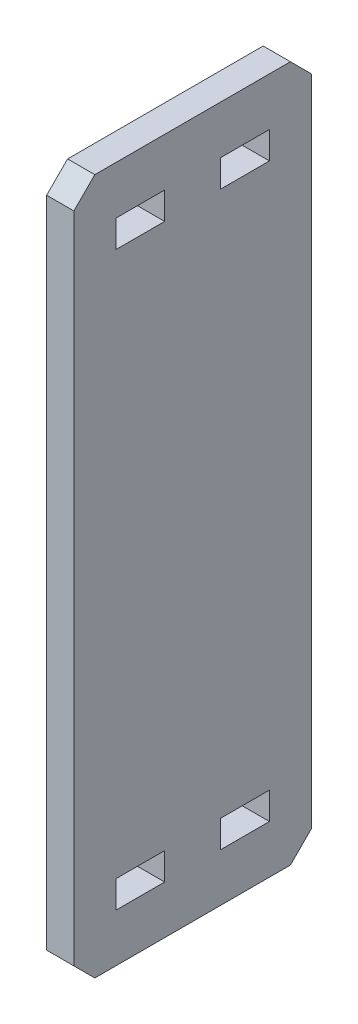
ISO-10303-21;
HEADER;
FILE_DESCRIPTION(('STEP AP214'),'2;1');
FILE_NAME('part.step','',(''),(''),'','','');
FILE_SCHEMA(('AUTOMOTIVE_DESIGN { 1 0 10303 214 1 1 1 1 }'));
ENDSEC;
DATA;
#1=APPLICATION_CONTEXT('core data for automotive mechanical design processes');
#2=APPLICATION_PROTOCOL_DEFINITION('international standard','automotive_design',2000,#1);
#3=PRODUCT_CONTEXT('',#1,'mechanical');
#4=PRODUCT('Part','Part','',(#3));
#5=PRODUCT_RELATED_PRODUCT_CATEGORY('part','',(#4));
#6=PRODUCT_DEFINITION_FORMATION('','',#4);
#7=PRODUCT_DEFINITION_CONTEXT('part definition',#1,'design');
#8=PRODUCT_DEFINITION('design','',#6,#7);
#9=PRODUCT_DEFINITION_SHAPE('','',#8);
#10=(LENGTH_UNIT() NAMED_UNIT(*) SI_UNIT(.MILLI.,.METRE.));
#11=(NAMED_UNIT(*) PLANE_ANGLE_UNIT() SI_UNIT($,.RADIAN.));
#12=(NAMED_UNIT(*) SI_UNIT($,.STERADIAN.) SOLID_ANGLE_UNIT());
#13=UNCERTAINTY_MEASURE_WITH_UNIT(LENGTH_MEASURE(1.E-05),#10,'distance_accuracy_value','');
#14=(GEOMETRIC_REPRESENTATION_CONTEXT(3) GLOBAL_UNCERTAINTY_ASSIGNED_CONTEXT((#13)) GLOBAL_UNIT_ASSIGNED_CONTEXT((#10,
#11,#12)) REPRESENTATION_CONTEXT('',''));
#15=CARTESIAN_POINT('',(0.,0.,0.));
#16=DIRECTION('',(0.,0.,1.));
#17=DIRECTION('',(1.,0.,0.));
#18=AXIS2_PLACEMENT_3D('',#15,#16,#17);
#19=CARTESIAN_POINT('',(2.4765,0.,0.));
#20=DIRECTION('',(-1.,0.,0.));
#21=DIRECTION('',(0.,0.,1.));
#22=AXIS2_PLACEMENT_3D('',#19,#20,#21);
#23=PLANE('',#22);
#24=DIRECTION('',(0.,0.,1.));
#25=VECTOR('',#24,1.);
#26=CARTESIAN_POINT('',(2.4765,-49.53,116.107292876109));
#27=LINE('',#26,#25);
#28=CARTESIAN_POINT('',(2.4765,-49.53,116.107292876109));
#29=VERTEX_POINT('',#28);
#30=CARTESIAN_POINT('',(2.4765,-49.53,124.997292876109));
#31=VERTEX_POINT('',#30);
#32=EDGE_CURVE('E238',#29,#31,#27,.T.);
#33=ORIENTED_EDGE('',*,*,#32,.F.);
#34=DIRECTION('',(0.,1.,0.));
#35=VECTOR('',#34,1.);
#36=CARTESIAN_POINT('',(2.4765,-49.53,116.107292876109));
#37=LINE('',#36,#35);
#38=CARTESIAN_POINT('',(2.4765,-54.483,116.107292876109));
#39=VERTEX_POINT('',#38);
#40=EDGE_CURVE('E246',#39,#29,#37,.T.);
#41=ORIENTED_EDGE('',*,*,#40,.F.);
#42=DIRECTION('',(0.,0.,-1.));
#43=VECTOR('',#42,1.);
#44=CARTESIAN_POINT('',(2.4765,-54.483,116.107292876109));
#45=LINE('',#44,#43);
#46=CARTESIAN_POINT('',(2.4765,-54.483,124.997292876109));
#47=VERTEX_POINT('',#46);
#48=EDGE_CURVE('E243',#47,#39,#45,.T.);
#49=ORIENTED_EDGE('',*,*,#48,.F.);
#50=DIRECTION('',(0.,-1.,0.));
#51=VECTOR('',#50,1.);
#52=CARTESIAN_POINT('',(2.4765,-49.53,124.997292876109));
#53=LINE('',#52,#51);
#54=EDGE_CURVE('E240',#31,#47,#53,.T.);
#55=ORIENTED_EDGE('',*,*,#54,.F.);
#56=EDGE_LOOP('',(#33,#41,#49,#55));
#57=FACE_BOUND('',#56,.T.);
#58=DIRECTION('',(0.,-1.,0.));
#59=VECTOR('',#58,1.);
#60=CARTESIAN_POINT('',(2.4765,54.483,105.947292876109));
#61=LINE('',#60,#59);
#62=CARTESIAN_POINT('',(2.4765,54.483,105.947292876109));
#63=VERTEX_POINT('',#62);
#64=CARTESIAN_POINT('',(2.4765,49.53,105.947292876109));
#65=VERTEX_POINT('',#64);
#66=EDGE_CURVE('E300',#63,#65,#61,.T.);
#67=ORIENTED_EDGE('',*,*,#66,.F.);
#68=DIRECTION('',(0.,0.,1.));
#69=VECTOR('',#68,1.);
#70=CARTESIAN_POINT('',(2.4765,54.483,97.0572928761086));
#71=LINE('',#70,#69);
#72=CARTESIAN_POINT('',(2.4765,54.483,97.0572928761086));
#73=VERTEX_POINT('',#72);
#74=EDGE_CURVE('E308',#73,#63,#71,.T.);
#75=ORIENTED_EDGE('',*,*,#74,.F.);
#76=DIRECTION('',(0.,1.,0.));
#77=VECTOR('',#76,1.);
#78=CARTESIAN_POINT('',(2.4765,54.483,97.0572928761086));
#79=LINE('',#78,#77);
#80=CARTESIAN_POINT('',(2.4765,49.53,97.0572928761086));
#81=VERTEX_POINT('',#80);
#82=EDGE_CURVE('E305',#81,#73,#79,.T.);
#83=ORIENTED_EDGE('',*,*,#82,.F.);
#84=DIRECTION('',(0.,0.,-1.));
#85=VECTOR('',#84,1.);
#86=CARTESIAN_POINT('',(2.4765,49.53,97.0572928761086));
#87=LINE('',#86,#85);
#88=EDGE_CURVE('E302',#65,#81,#87,.T.);
#89=ORIENTED_EDGE('',*,*,#88,.F.);
#90=EDGE_LOOP('',(#67,#75,#83,#89));
#91=FACE_BOUND('',#90,.T.);
#92=DIRECTION('',(0.,0.,-1.));
#93=VECTOR('',#92,1.);
#94=CARTESIAN_POINT('',(2.4765,-63.246,89.4372928761086));
#95=LINE('',#94,#93);
#96=CARTESIAN_POINT('',(2.4765,-63.246,128.807292876109));
#97=VERTEX_POINT('',#96);
#98=CARTESIAN_POINT('',(2.4765,-63.246,93.2472928761086));
#99=VERTEX_POINT('',#98);
#100=EDGE_CURVE('E339',#97,#99,#95,.T.);
#101=ORIENTED_EDGE('',*,*,#100,.T.);
#102=DIRECTION('',(0.,-0.707106781186548,0.707106781186548));
#103=VECTOR('',#102,1.);
#104=CARTESIAN_POINT('',(2.4765,-59.436,89.4372928761086));
#105=LINE('',#104,#103);
#106=CARTESIAN_POINT('',(2.4765,-59.436,89.4372928761086));
#107=VERTEX_POINT('',#106);
#108=EDGE_CURVE('E374',#99,#107,#105,.F.);
#109=ORIENTED_EDGE('',*,*,#108,.T.);
#110=DIRECTION('',(0.,1.,0.));
#111=VECTOR('',#110,1.);
#112=CARTESIAN_POINT('',(2.4765,63.246,89.4372928761086));
#113=LINE('',#112,#111);
#114=CARTESIAN_POINT('',(2.4765,59.436,89.4372928761086));
#115=VERTEX_POINT('',#114);
#116=EDGE_CURVE('E331',#107,#115,#113,.T.);
#117=ORIENTED_EDGE('',*,*,#116,.T.);
#118=DIRECTION('',(0.,-0.707106781186548,-0.707106781186547));
#119=VECTOR('',#118,1.);
#120=CARTESIAN_POINT('',(2.4765,63.246,93.2472928761086));
#121=LINE('',#120,#119);
#122=CARTESIAN_POINT('',(2.4765,63.246,93.2472928761086));
#123=VERTEX_POINT('',#122);
#124=EDGE_CURVE('E370',#115,#123,#121,.F.);
#125=ORIENTED_EDGE('',*,*,#124,.T.);
#126=DIRECTION('',(0.,0.,1.));
#127=VECTOR('',#126,1.);
#128=CARTESIAN_POINT('',(2.4765,63.246,89.4372928761086));
#129=LINE('',#128,#127);
#130=CARTESIAN_POINT('',(2.4765,63.246,128.807292876109));
#131=VERTEX_POINT('',#130);
#132=EDGE_CURVE('E334',#123,#131,#129,.T.);
#133=ORIENTED_EDGE('',*,*,#132,.T.);
#134=DIRECTION('',(0.,0.707106781186546,-0.707106781186549));
#135=VECTOR('',#134,1.);
#136=CARTESIAN_POINT('',(2.4765,59.436,132.617292876109));
#137=LINE('',#136,#135);
#138=CARTESIAN_POINT('',(2.4765,59.436,132.617292876109));
#139=VERTEX_POINT('',#138);
#140=EDGE_CURVE('E55',#131,#139,#137,.F.);
#141=ORIENTED_EDGE('',*,*,#140,.T.);
#142=DIRECTION('',(0.,-1.,0.));
#143=VECTOR('',#142,1.);
#144=CARTESIAN_POINT('',(2.4765,63.246,132.617292876109));
#145=LINE('',#144,#143);
#146=CARTESIAN_POINT('',(2.4765,-59.436,132.617292876109));
#147=VERTEX_POINT('',#146);
#148=EDGE_CURVE('E337',#139,#147,#145,.T.);
#149=ORIENTED_EDGE('',*,*,#148,.T.);
#150=DIRECTION('',(0.,0.707106781186549,0.707106781186546));
#151=VECTOR('',#150,1.);
#152=CARTESIAN_POINT('',(2.4765,-63.246,128.807292876109));
#153=LINE('',#152,#151);
#154=EDGE_CURVE('E372',#147,#97,#153,.F.);
#155=ORIENTED_EDGE('',*,*,#154,.T.);
#156=EDGE_LOOP('',(#101,#109,#117,#125,#133,#141,#149,#155));
#157=FACE_BOUND('',#156,.T.);
#158=DIRECTION('',(0.,0.,1.));
#159=VECTOR('',#158,1.);
#160=CARTESIAN_POINT('',(2.4765,54.483,116.107292876109));
#161=LINE('',#160,#159);
#162=CARTESIAN_POINT('',(2.4765,54.483,116.107292876109));
#163=VERTEX_POINT('',#162);
#164=CARTESIAN_POINT('',(2.4765,54.483,124.997292876109));
#165=VERTEX_POINT('',#164);
#166=EDGE_CURVE('E269',#163,#165,#161,.T.);
#167=ORIENTED_EDGE('',*,*,#166,.F.);
#168=DIRECTION('',(0.,1.,0.));
#169=VECTOR('',#168,1.);
#170=CARTESIAN_POINT('',(2.4765,54.483,116.107292876109));
#171=LINE('',#170,#169);
#172=CARTESIAN_POINT('',(2.4765,49.53,116.107292876109));
#173=VERTEX_POINT('',#172);
#174=EDGE_CURVE('E277',#173,#163,#171,.T.);
#175=ORIENTED_EDGE('',*,*,#174,.F.);
#176=DIRECTION('',(0.,0.,-1.));
#177=VECTOR('',#176,1.);
#178=CARTESIAN_POINT('',(2.4765,49.53,116.107292876109));
#179=LINE('',#178,#177);
#180=CARTESIAN_POINT('',(2.4765,49.53,124.997292876109));
#181=VERTEX_POINT('',#180);
#182=EDGE_CURVE('E274',#181,#173,#179,.T.);
#183=ORIENTED_EDGE('',*,*,#182,.F.);
#184=DIRECTION('',(0.,-1.,0.));
#185=VECTOR('',#184,1.);
#186=CARTESIAN_POINT('',(2.4765,54.483,124.997292876109));
#187=LINE('',#186,#185);
#188=EDGE_CURVE('E271',#165,#181,#187,.T.);
#189=ORIENTED_EDGE('',*,*,#188,.F.);
#190=EDGE_LOOP('',(#167,#175,#183,#189));
#191=FACE_BOUND('',#190,.T.);
#192=DIRECTION('',(0.,-1.,0.));
#193=VECTOR('',#192,1.);
#194=CARTESIAN_POINT('',(2.4765,-49.53,105.947292876109));
#195=LINE('',#194,#193);
#196=CARTESIAN_POINT('',(2.4765,-49.53,105.947292876109));
#197=VERTEX_POINT('',#196);
#198=CARTESIAN_POINT('',(2.4765,-54.483,105.947292876109));
#199=VERTEX_POINT('',#198);
#200=EDGE_CURVE('E197',#197,#199,#195,.T.);
#201=ORIENTED_EDGE('',*,*,#200,.F.);
#202=DIRECTION('',(0.,0.,1.));
#203=VECTOR('',#202,1.);
#204=CARTESIAN_POINT('',(2.4765,-49.53,97.0572928761086));
#205=LINE('',#204,#203);
#206=CARTESIAN_POINT('',(2.4765,-49.53,97.0572928761086));
#207=VERTEX_POINT('',#206);
#208=EDGE_CURVE('E222',#207,#197,#205,.T.);
#209=ORIENTED_EDGE('',*,*,#208,.F.);
#210=DIRECTION('',(0.,1.,0.));
#211=VECTOR('',#210,1.);
#212=CARTESIAN_POINT('',(2.4765,-49.53,97.0572928761086));
#213=LINE('',#212,#211);
#214=CARTESIAN_POINT('',(2.4765,-54.483,97.0572928761086));
#215=VERTEX_POINT('',#214);
#216=EDGE_CURVE('E220',#215,#207,#213,.T.);
#217=ORIENTED_EDGE('',*,*,#216,.F.);
#218=DIRECTION('',(0.,0.,-1.));
#219=VECTOR('',#218,1.);
#220=CARTESIAN_POINT('',(2.4765,-54.483,97.0572928761086));
#221=LINE('',#220,#219);
#222=EDGE_CURVE('E207',#199,#215,#221,.T.);
#223=ORIENTED_EDGE('',*,*,#222,.F.);
#224=EDGE_LOOP('',(#201,#209,#217,#223));
#225=FACE_BOUND('',#224,.T.);
#226=ADVANCED_FACE('F33',(#57,#91,#157,#191,#225),#23,.F.);
#227=CARTESIAN_POINT('',(-2.4765,0.,0.));
#228=DIRECTION('',(-1.,0.,0.));
#229=DIRECTION('',(0.,0.,1.));
#230=AXIS2_PLACEMENT_3D('',#227,#228,#229);
#231=PLANE('',#230);
#232=DIRECTION('',(0.,1.,0.));
#233=VECTOR('',#232,1.);
#234=CARTESIAN_POINT('',(-2.4765,63.246,89.4372928761086));
#235=LINE('',#234,#233);
#236=CARTESIAN_POINT('',(-2.4765,-59.436,89.4372928761086));
#237=VERTEX_POINT('',#236);
#238=CARTESIAN_POINT('',(-2.4765,59.436,89.4372928761086));
#239=VERTEX_POINT('',#238);
#240=EDGE_CURVE('E330',#237,#239,#235,.T.);
#241=ORIENTED_EDGE('',*,*,#240,.F.);
#242=DIRECTION('',(0.,0.707106781186548,-0.707106781186548));
#243=VECTOR('',#242,1.);
#244=CARTESIAN_POINT('',(-2.4765,15.0006464380543,15.0006464380543));
#245=LINE('',#244,#243);
#246=CARTESIAN_POINT('',(-2.4765,-63.246,93.2472928761086));
#247=VERTEX_POINT('',#246);
#248=EDGE_CURVE('E362',#237,#247,#245,.F.);
#249=ORIENTED_EDGE('',*,*,#248,.T.);
#250=DIRECTION('',(0.,0.,-1.));
#251=VECTOR('',#250,1.);
#252=CARTESIAN_POINT('',(-2.4765,-63.246,89.4372928761086));
#253=LINE('',#252,#251);
#254=CARTESIAN_POINT('',(-2.4765,-63.246,128.807292876109));
#255=VERTEX_POINT('',#254);
#256=EDGE_CURVE('E335',#255,#247,#253,.T.);
#257=ORIENTED_EDGE('',*,*,#256,.F.);
#258=DIRECTION('',(0.,-0.707106781186549,-0.707106781186546));
#259=VECTOR('',#258,1.);
#260=CARTESIAN_POINT('',(-2.4765,-96.0266464380542,96.0266464380545));
#261=LINE('',#260,#259);
#262=CARTESIAN_POINT('',(-2.4765,-59.436,132.617292876109));
#263=VERTEX_POINT('',#262);
#264=EDGE_CURVE('E360',#255,#263,#261,.F.);
#265=ORIENTED_EDGE('',*,*,#264,.T.);
#266=DIRECTION('',(0.,-1.,0.));
#267=VECTOR('',#266,1.);
#268=CARTESIAN_POINT('',(-2.4765,63.246,132.617292876109));
#269=LINE('',#268,#267);
#270=CARTESIAN_POINT('',(-2.4765,59.436,132.617292876109));
#271=VERTEX_POINT('',#270);
#272=EDGE_CURVE('E348',#271,#263,#269,.T.);
#273=ORIENTED_EDGE('',*,*,#272,.F.);
#274=DIRECTION('',(0.,-0.707106781186546,0.707106781186549));
#275=VECTOR('',#274,1.);
#276=CARTESIAN_POINT('',(-2.4765,96.0266464380544,96.026646438054));
#277=LINE('',#276,#275);
#278=CARTESIAN_POINT('',(-2.4765,63.246,128.807292876109));
#279=VERTEX_POINT('',#278);
#280=EDGE_CURVE('E356',#271,#279,#277,.F.);
#281=ORIENTED_EDGE('',*,*,#280,.T.);
#282=DIRECTION('',(0.,0.,1.));
#283=VECTOR('',#282,1.);
#284=CARTESIAN_POINT('',(-2.4765,63.246,89.4372928761086));
#285=LINE('',#284,#283);
#286=CARTESIAN_POINT('',(-2.4765,63.246,93.2472928761087));
#287=VERTEX_POINT('',#286);
#288=EDGE_CURVE('E345',#287,#279,#285,.T.);
#289=ORIENTED_EDGE('',*,*,#288,.F.);
#290=DIRECTION('',(0.,0.707106781186548,0.707106781186547));
#291=VECTOR('',#290,1.);
#292=CARTESIAN_POINT('',(-2.4765,-15.0006464380544,15.0006464380544));
#293=LINE('',#292,#291);
#294=EDGE_CURVE('E358',#287,#239,#293,.F.);
#295=ORIENTED_EDGE('',*,*,#294,.T.);
#296=EDGE_LOOP('',(#241,#249,#257,#265,#273,#281,#289,#295));
#297=FACE_BOUND('',#296,.T.);
#298=DIRECTION('',(0.,0.,1.));
#299=VECTOR('',#298,1.);
#300=CARTESIAN_POINT('',(-2.4765,54.483,97.0572928761086));
#301=LINE('',#300,#299);
#302=CARTESIAN_POINT('',(-2.4765,54.483,97.0572928761086));
#303=VERTEX_POINT('',#302);
#304=CARTESIAN_POINT('',(-2.4765,54.483,105.947292876109));
#305=VERTEX_POINT('',#304);
#306=EDGE_CURVE('E303',#303,#305,#301,.T.);
#307=ORIENTED_EDGE('',*,*,#306,.T.);
#308=DIRECTION('',(0.,-1.,0.));
#309=VECTOR('',#308,1.);
#310=CARTESIAN_POINT('',(-2.4765,54.483,105.947292876109));
#311=LINE('',#310,#309);
#312=CARTESIAN_POINT('',(-2.4765,49.53,105.947292876109));
#313=VERTEX_POINT('',#312);
#314=EDGE_CURVE('E299',#305,#313,#311,.T.);
#315=ORIENTED_EDGE('',*,*,#314,.T.);
#316=DIRECTION('',(0.,0.,-1.));
#317=VECTOR('',#316,1.);
#318=CARTESIAN_POINT('',(-2.4765,49.53,97.0572928761086));
#319=LINE('',#318,#317);
#320=CARTESIAN_POINT('',(-2.4765,49.53,97.0572928761086));
#321=VERTEX_POINT('',#320);
#322=EDGE_CURVE('E313',#313,#321,#319,.T.);
#323=ORIENTED_EDGE('',*,*,#322,.T.);
#324=DIRECTION('',(0.,1.,0.));
#325=VECTOR('',#324,1.);
#326=CARTESIAN_POINT('',(-2.4765,54.483,97.0572928761086));
#327=LINE('',#326,#325);
#328=EDGE_CURVE('E316',#321,#303,#327,.T.);
#329=ORIENTED_EDGE('',*,*,#328,.T.);
#330=EDGE_LOOP('',(#307,#315,#323,#329));
#331=FACE_BOUND('',#330,.T.);
#332=DIRECTION('',(0.,1.,0.));
#333=VECTOR('',#332,1.);
#334=CARTESIAN_POINT('',(-2.4765,54.483,116.107292876109));
#335=LINE('',#334,#333);
#336=CARTESIAN_POINT('',(-2.4765,49.53,116.107292876109));
#337=VERTEX_POINT('',#336);
#338=CARTESIAN_POINT('',(-2.4765,54.483,116.107292876109));
#339=VERTEX_POINT('',#338);
#340=EDGE_CURVE('E272',#337,#339,#335,.T.);
#341=ORIENTED_EDGE('',*,*,#340,.T.);
#342=DIRECTION('',(0.,0.,1.));
#343=VECTOR('',#342,1.);
#344=CARTESIAN_POINT('',(-2.4765,54.483,116.107292876109));
#345=LINE('',#344,#343);
#346=CARTESIAN_POINT('',(-2.4765,54.483,124.997292876109));
#347=VERTEX_POINT('',#346);
#348=EDGE_CURVE('E268',#339,#347,#345,.T.);
#349=ORIENTED_EDGE('',*,*,#348,.T.);
#350=DIRECTION('',(0.,-1.,0.));
#351=VECTOR('',#350,1.);
#352=CARTESIAN_POINT('',(-2.4765,54.483,124.997292876109));
#353=LINE('',#352,#351);
#354=CARTESIAN_POINT('',(-2.4765,49.53,124.997292876109));
#355=VERTEX_POINT('',#354);
#356=EDGE_CURVE('E282',#347,#355,#353,.T.);
#357=ORIENTED_EDGE('',*,*,#356,.T.);
#358=DIRECTION('',(0.,0.,-1.));
#359=VECTOR('',#358,1.);
#360=CARTESIAN_POINT('',(-2.4765,49.53,116.107292876109));
#361=LINE('',#360,#359);
#362=EDGE_CURVE('E285',#355,#337,#361,.T.);
#363=ORIENTED_EDGE('',*,*,#362,.T.);
#364=EDGE_LOOP('',(#341,#349,#357,#363));
#365=FACE_BOUND('',#364,.T.);
#366=DIRECTION('',(0.,1.,0.));
#367=VECTOR('',#366,1.);
#368=CARTESIAN_POINT('',(-2.4765,-49.53,116.107292876109));
#369=LINE('',#368,#367);
#370=CARTESIAN_POINT('',(-2.4765,-54.483,116.107292876109));
#371=VERTEX_POINT('',#370);
#372=CARTESIAN_POINT('',(-2.4765,-49.53,116.107292876109));
#373=VERTEX_POINT('',#372);
#374=EDGE_CURVE('E241',#371,#373,#369,.T.);
#375=ORIENTED_EDGE('',*,*,#374,.T.);
#376=DIRECTION('',(0.,0.,1.));
#377=VECTOR('',#376,1.);
#378=CARTESIAN_POINT('',(-2.4765,-49.53,116.107292876109));
#379=LINE('',#378,#377);
#380=CARTESIAN_POINT('',(-2.4765,-49.53,124.997292876109));
#381=VERTEX_POINT('',#380);
#382=EDGE_CURVE('E215',#373,#381,#379,.T.);
#383=ORIENTED_EDGE('',*,*,#382,.T.);
#384=DIRECTION('',(0.,-1.,0.));
#385=VECTOR('',#384,1.);
#386=CARTESIAN_POINT('',(-2.4765,-49.53,124.997292876109));
#387=LINE('',#386,#385);
#388=CARTESIAN_POINT('',(-2.4765,-54.483,124.997292876109));
#389=VERTEX_POINT('',#388);
#390=EDGE_CURVE('E251',#381,#389,#387,.T.);
#391=ORIENTED_EDGE('',*,*,#390,.T.);
#392=DIRECTION('',(0.,0.,-1.));
#393=VECTOR('',#392,1.);
#394=CARTESIAN_POINT('',(-2.4765,-54.483,116.107292876109));
#395=LINE('',#394,#393);
#396=EDGE_CURVE('E254',#389,#371,#395,.T.);
#397=ORIENTED_EDGE('',*,*,#396,.T.);
#398=EDGE_LOOP('',(#375,#383,#391,#397));
#399=FACE_BOUND('',#398,.T.);
#400=DIRECTION('',(0.,0.,1.));
#401=VECTOR('',#400,1.);
#402=CARTESIAN_POINT('',(-2.4765,-49.53,97.0572928761086));
#403=LINE('',#402,#401);
#404=CARTESIAN_POINT('',(-2.4765,-49.53,97.0572928761086));
#405=VERTEX_POINT('',#404);
#406=CARTESIAN_POINT('',(-2.4765,-49.53,105.947292876109));
#407=VERTEX_POINT('',#406);
#408=EDGE_CURVE('E208',#405,#407,#403,.T.);
#409=ORIENTED_EDGE('',*,*,#408,.T.);
#410=DIRECTION('',(0.,-1.,0.));
#411=VECTOR('',#410,1.);
#412=CARTESIAN_POINT('',(-2.4765,-49.53,105.947292876109));
#413=LINE('',#412,#411);
#414=CARTESIAN_POINT('',(-2.4765,-54.483,105.947292876109));
#415=VERTEX_POINT('',#414);
#416=EDGE_CURVE('E226',#407,#415,#413,.T.);
#417=ORIENTED_EDGE('',*,*,#416,.T.);
#418=DIRECTION('',(0.,0.,-1.));
#419=VECTOR('',#418,1.);
#420=CARTESIAN_POINT('',(-2.4765,-54.483,97.0572928761086));
#421=LINE('',#420,#419);
#422=CARTESIAN_POINT('',(-2.4765,-54.483,97.0572928761086));
#423=VERTEX_POINT('',#422);
#424=EDGE_CURVE('E214',#415,#423,#421,.T.);
#425=ORIENTED_EDGE('',*,*,#424,.T.);
#426=DIRECTION('',(0.,1.,0.));
#427=VECTOR('',#426,1.);
#428=CARTESIAN_POINT('',(-2.4765,-49.53,97.0572928761086));
#429=LINE('',#428,#427);
#430=EDGE_CURVE('E229',#423,#405,#429,.T.);
#431=ORIENTED_EDGE('',*,*,#430,.T.);
#432=EDGE_LOOP('',(#409,#417,#425,#431));
#433=FACE_BOUND('',#432,.T.);
#434=ADVANCED_FACE('F393',(#297,#331,#365,#399,#433),#231,.T.);
#435=CARTESIAN_POINT('',(2.4765,63.246,89.4372928761086));
#436=DIRECTION('',(0.,0.,1.));
#437=DIRECTION('',(0.,-1.,0.));
#438=AXIS2_PLACEMENT_3D('',#435,#436,#437);
#439=PLANE('',#438);
#440=ORIENTED_EDGE('',*,*,#116,.F.);
#441=DIRECTION('',(-1.,0.,0.));
#442=VECTOR('',#441,1.);
#443=CARTESIAN_POINT('',(2.4765,-59.436,89.4372928761086));
#444=LINE('',#443,#442);
#445=EDGE_CURVE('E353',#107,#237,#444,.T.);
#446=ORIENTED_EDGE('',*,*,#445,.T.);
#447=ORIENTED_EDGE('',*,*,#240,.T.);
#448=DIRECTION('',(1.,0.,0.));
#449=VECTOR('',#448,1.);
#450=CARTESIAN_POINT('',(2.4765,59.436,89.4372928761086));
#451=LINE('',#450,#449);
#452=EDGE_CURVE('E342',#239,#115,#451,.T.);
#453=ORIENTED_EDGE('',*,*,#452,.T.);
#454=EDGE_LOOP('',(#440,#446,#447,#453));
#455=FACE_BOUND('',#454,.T.);
#456=ADVANCED_FACE('F410',(#455),#439,.F.);
#457=CARTESIAN_POINT('',(2.4765,63.246,89.4372928761086));
#458=DIRECTION('',(0.,-1.,0.));
#459=DIRECTION('',(0.,0.,-1.));
#460=AXIS2_PLACEMENT_3D('',#457,#458,#459);
#461=PLANE('',#460);
#462=ORIENTED_EDGE('',*,*,#132,.F.);
#463=DIRECTION('',(-1.,0.,0.));
#464=VECTOR('',#463,1.);
#465=CARTESIAN_POINT('',(2.4765,63.246,93.2472928761086));
#466=LINE('',#465,#464);
#467=EDGE_CURVE('E11',#123,#287,#466,.T.);
#468=ORIENTED_EDGE('',*,*,#467,.T.);
#469=ORIENTED_EDGE('',*,*,#288,.T.);
#470=DIRECTION('',(1.,0.,0.));
#471=VECTOR('',#470,1.);
#472=CARTESIAN_POINT('',(2.4765,63.246,128.807292876109));
#473=LINE('',#472,#471);
#474=EDGE_CURVE('E41',#279,#131,#473,.T.);
#475=ORIENTED_EDGE('',*,*,#474,.T.);
#476=EDGE_LOOP('',(#462,#468,#469,#475));
#477=FACE_BOUND('',#476,.T.);
#478=ADVANCED_FACE('F382',(#477),#461,.F.);
#479=CARTESIAN_POINT('',(2.4765,63.246,132.617292876109));
#480=DIRECTION('',(0.,0.,-1.));
#481=DIRECTION('',(-1.,0.,0.));
#482=AXIS2_PLACEMENT_3D('',#479,#480,#481);
#483=PLANE('',#482);
#484=ORIENTED_EDGE('',*,*,#272,.T.);
#485=DIRECTION('',(1.,0.,0.));
#486=VECTOR('',#485,1.);
#487=CARTESIAN_POINT('',(2.4765,-59.436,132.617292876109));
#488=LINE('',#487,#486);
#489=EDGE_CURVE('E48',#263,#147,#488,.T.);
#490=ORIENTED_EDGE('',*,*,#489,.T.);
#491=ORIENTED_EDGE('',*,*,#148,.F.);
#492=DIRECTION('',(-1.,0.,0.));
#493=VECTOR('',#492,1.);
#494=CARTESIAN_POINT('',(2.4765,59.436,132.617292876109));
#495=LINE('',#494,#493);
#496=EDGE_CURVE('E376',#139,#271,#495,.T.);
#497=ORIENTED_EDGE('',*,*,#496,.T.);
#498=EDGE_LOOP('',(#484,#490,#491,#497));
#499=FACE_BOUND('',#498,.T.);
#500=ADVANCED_FACE('F390',(#499),#483,.F.);
#501=CARTESIAN_POINT('',(2.4765,-63.246,89.4372928761086));
#502=DIRECTION('',(0.,1.,0.));
#503=DIRECTION('',(0.,0.,1.));
#504=AXIS2_PLACEMENT_3D('',#501,#502,#503);
#505=PLANE('',#504);
#506=ORIENTED_EDGE('',*,*,#256,.T.);
#507=DIRECTION('',(1.,0.,0.));
#508=VECTOR('',#507,1.);
#509=CARTESIAN_POINT('',(2.4765,-63.246,93.2472928761086));
#510=LINE('',#509,#508);
#511=EDGE_CURVE('E367',#247,#99,#510,.T.);
#512=ORIENTED_EDGE('',*,*,#511,.T.);
#513=ORIENTED_EDGE('',*,*,#100,.F.);
#514=DIRECTION('',(-1.,0.,0.));
#515=VECTOR('',#514,1.);
#516=CARTESIAN_POINT('',(2.4765,-63.246,128.807292876109));
#517=LINE('',#516,#515);
#518=EDGE_CURVE('E364',#97,#255,#517,.T.);
#519=ORIENTED_EDGE('',*,*,#518,.T.);
#520=EDGE_LOOP('',(#506,#512,#513,#519));
#521=FACE_BOUND('',#520,.T.);
#522=ADVANCED_FACE('F402',(#521),#505,.F.);
#523=CARTESIAN_POINT('',(2.4765,54.483,105.947292876109));
#524=DIRECTION('',(0.,0.,-1.));
#525=DIRECTION('',(-1.,0.,0.));
#526=AXIS2_PLACEMENT_3D('',#523,#524,#525);
#527=PLANE('',#526);
#528=ORIENTED_EDGE('',*,*,#314,.F.);
#529=DIRECTION('',(-1.,0.,0.));
#530=VECTOR('',#529,1.);
#531=CARTESIAN_POINT('',(2.4765,54.483,105.947292876109));
#532=LINE('',#531,#530);
#533=EDGE_CURVE('E310',#63,#305,#532,.T.);
#534=ORIENTED_EDGE('',*,*,#533,.F.);
#535=ORIENTED_EDGE('',*,*,#66,.T.);
#536=DIRECTION('',(-1.,0.,0.));
#537=VECTOR('',#536,1.);
#538=CARTESIAN_POINT('',(2.4765,49.53,105.947292876109));
#539=LINE('',#538,#537);
#540=EDGE_CURVE('E327',#65,#313,#539,.T.);
#541=ORIENTED_EDGE('',*,*,#540,.T.);
#542=EDGE_LOOP('',(#528,#534,#535,#541));
#543=FACE_BOUND('',#542,.T.);
#544=ADVANCED_FACE('F430',(#543),#527,.T.);
#545=CARTESIAN_POINT('',(2.4765,49.53,97.0572928761086));
#546=DIRECTION('',(0.,1.,0.));
#547=DIRECTION('',(0.,0.,1.));
#548=AXIS2_PLACEMENT_3D('',#545,#546,#547);
#549=PLANE('',#548);
#550=ORIENTED_EDGE('',*,*,#322,.F.);
#551=ORIENTED_EDGE('',*,*,#540,.F.);
#552=ORIENTED_EDGE('',*,*,#88,.T.);
#553=DIRECTION('',(-1.,0.,0.));
#554=VECTOR('',#553,1.);
#555=CARTESIAN_POINT('',(2.4765,49.53,97.0572928761086));
#556=LINE('',#555,#554);
#557=EDGE_CURVE('E325',#81,#321,#556,.T.);
#558=ORIENTED_EDGE('',*,*,#557,.T.);
#559=EDGE_LOOP('',(#550,#551,#552,#558));
#560=FACE_BOUND('',#559,.T.);
#561=ADVANCED_FACE('F498',(#560),#549,.T.);
#562=CARTESIAN_POINT('',(2.4765,54.483,97.0572928761086));
#563=DIRECTION('',(0.,0.,1.));
#564=DIRECTION('',(1.,0.,0.));
#565=AXIS2_PLACEMENT_3D('',#562,#563,#564);
#566=PLANE('',#565);
#567=ORIENTED_EDGE('',*,*,#328,.F.);
#568=ORIENTED_EDGE('',*,*,#557,.F.);
#569=ORIENTED_EDGE('',*,*,#82,.T.);
#570=DIRECTION('',(-1.,0.,0.));
#571=VECTOR('',#570,1.);
#572=CARTESIAN_POINT('',(2.4765,54.483,97.0572928761086));
#573=LINE('',#572,#571);
#574=EDGE_CURVE('E323',#73,#303,#573,.T.);
#575=ORIENTED_EDGE('',*,*,#574,.T.);
#576=EDGE_LOOP('',(#567,#568,#569,#575));
#577=FACE_BOUND('',#576,.T.);
#578=ADVANCED_FACE('F495',(#577),#566,.T.);
#579=CARTESIAN_POINT('',(2.4765,54.483,97.0572928761086));
#580=DIRECTION('',(0.,-1.,0.));
#581=DIRECTION('',(0.,0.,-1.));
#582=AXIS2_PLACEMENT_3D('',#579,#580,#581);
#583=PLANE('',#582);
#584=ORIENTED_EDGE('',*,*,#306,.F.);
#585=ORIENTED_EDGE('',*,*,#574,.F.);
#586=ORIENTED_EDGE('',*,*,#74,.T.);
#587=ORIENTED_EDGE('',*,*,#533,.T.);
#588=EDGE_LOOP('',(#584,#585,#586,#587));
#589=FACE_BOUND('',#588,.T.);
#590=ADVANCED_FACE('F491',(#589),#583,.T.);
#591=CARTESIAN_POINT('',(2.4765,54.483,116.107292876109));
#592=DIRECTION('',(0.,-1.,0.));
#593=DIRECTION('',(0.,0.,-1.));
#594=AXIS2_PLACEMENT_3D('',#591,#592,#593);
#595=PLANE('',#594);
#596=ORIENTED_EDGE('',*,*,#348,.F.);
#597=DIRECTION('',(-1.,0.,0.));
#598=VECTOR('',#597,1.);
#599=CARTESIAN_POINT('',(2.4765,54.483,116.107292876109));
#600=LINE('',#599,#598);
#601=EDGE_CURVE('E279',#163,#339,#600,.T.);
#602=ORIENTED_EDGE('',*,*,#601,.F.);
#603=ORIENTED_EDGE('',*,*,#166,.T.);
#604=DIRECTION('',(-1.,0.,0.));
#605=VECTOR('',#604,1.);
#606=CARTESIAN_POINT('',(2.4765,54.483,124.997292876109));
#607=LINE('',#606,#605);
#608=EDGE_CURVE('E296',#165,#347,#607,.T.);
#609=ORIENTED_EDGE('',*,*,#608,.T.);
#610=EDGE_LOOP('',(#596,#602,#603,#609));
#611=FACE_BOUND('',#610,.T.);
#612=ADVANCED_FACE('F487',(#611),#595,.T.);
#613=CARTESIAN_POINT('',(2.4765,54.483,124.997292876109));
#614=DIRECTION('',(0.,0.,-1.));
#615=DIRECTION('',(-1.,0.,0.));
#616=AXIS2_PLACEMENT_3D('',#613,#614,#615);
#617=PLANE('',#616);
#618=ORIENTED_EDGE('',*,*,#356,.F.);
#619=ORIENTED_EDGE('',*,*,#608,.F.);
#620=ORIENTED_EDGE('',*,*,#188,.T.);
#621=DIRECTION('',(-1.,0.,0.));
#622=VECTOR('',#621,1.);
#623=CARTESIAN_POINT('',(2.4765,49.53,124.997292876109));
#624=LINE('',#623,#622);
#625=EDGE_CURVE('E294',#181,#355,#624,.T.);
#626=ORIENTED_EDGE('',*,*,#625,.T.);
#627=EDGE_LOOP('',(#618,#619,#620,#626));
#628=FACE_BOUND('',#627,.T.);
#629=ADVANCED_FACE('F483',(#628),#617,.T.);
#630=CARTESIAN_POINT('',(2.4765,49.53,116.107292876109));
#631=DIRECTION('',(0.,1.,0.));
#632=DIRECTION('',(0.,0.,1.));
#633=AXIS2_PLACEMENT_3D('',#630,#631,#632);
#634=PLANE('',#633);
#635=ORIENTED_EDGE('',*,*,#362,.F.);
#636=ORIENTED_EDGE('',*,*,#625,.F.);
#637=ORIENTED_EDGE('',*,*,#182,.T.);
#638=DIRECTION('',(-1.,0.,0.));
#639=VECTOR('',#638,1.);
#640=CARTESIAN_POINT('',(2.4765,49.53,116.107292876109));
#641=LINE('',#640,#639);
#642=EDGE_CURVE('E292',#173,#337,#641,.T.);
#643=ORIENTED_EDGE('',*,*,#642,.T.);
#644=EDGE_LOOP('',(#635,#636,#637,#643));
#645=FACE_BOUND('',#644,.T.);
#646=ADVANCED_FACE('F479',(#645),#634,.T.);
#647=CARTESIAN_POINT('',(2.4765,54.483,116.107292876109));
#648=DIRECTION('',(0.,0.,1.));
#649=DIRECTION('',(1.,0.,0.));
#650=AXIS2_PLACEMENT_3D('',#647,#648,#649);
#651=PLANE('',#650);
#652=ORIENTED_EDGE('',*,*,#340,.F.);
#653=ORIENTED_EDGE('',*,*,#642,.F.);
#654=ORIENTED_EDGE('',*,*,#174,.T.);
#655=ORIENTED_EDGE('',*,*,#601,.T.);
#656=EDGE_LOOP('',(#652,#653,#654,#655));
#657=FACE_BOUND('',#656,.T.);
#658=ADVANCED_FACE('F475',(#657),#651,.T.);
#659=CARTESIAN_POINT('',(2.4765,-49.53,116.107292876109));
#660=DIRECTION('',(0.,-1.,0.));
#661=DIRECTION('',(0.,0.,-1.));
#662=AXIS2_PLACEMENT_3D('',#659,#660,#661);
#663=PLANE('',#662);
#664=ORIENTED_EDGE('',*,*,#382,.F.);
#665=DIRECTION('',(-1.,0.,0.));
#666=VECTOR('',#665,1.);
#667=CARTESIAN_POINT('',(2.4765,-49.53,116.107292876109));
#668=LINE('',#667,#666);
#669=EDGE_CURVE('E248',#29,#373,#668,.T.);
#670=ORIENTED_EDGE('',*,*,#669,.F.);
#671=ORIENTED_EDGE('',*,*,#32,.T.);
#672=DIRECTION('',(-1.,0.,0.));
#673=VECTOR('',#672,1.);
#674=CARTESIAN_POINT('',(2.4765,-49.53,124.997292876109));
#675=LINE('',#674,#673);
#676=EDGE_CURVE('E265',#31,#381,#675,.T.);
#677=ORIENTED_EDGE('',*,*,#676,.T.);
#678=EDGE_LOOP('',(#664,#670,#671,#677));
#679=FACE_BOUND('',#678,.T.);
#680=ADVANCED_FACE('F471',(#679),#663,.T.);
#681=CARTESIAN_POINT('',(2.4765,-49.53,124.997292876109));
#682=DIRECTION('',(0.,0.,-1.));
#683=DIRECTION('',(-1.,0.,0.));
#684=AXIS2_PLACEMENT_3D('',#681,#682,#683);
#685=PLANE('',#684);
#686=ORIENTED_EDGE('',*,*,#390,.F.);
#687=ORIENTED_EDGE('',*,*,#676,.F.);
#688=ORIENTED_EDGE('',*,*,#54,.T.);
#689=DIRECTION('',(-1.,0.,0.));
#690=VECTOR('',#689,1.);
#691=CARTESIAN_POINT('',(2.4765,-54.483,124.997292876109));
#692=LINE('',#691,#690);
#693=EDGE_CURVE('E263',#47,#389,#692,.T.);
#694=ORIENTED_EDGE('',*,*,#693,.T.);
#695=EDGE_LOOP('',(#686,#687,#688,#694));
#696=FACE_BOUND('',#695,.T.);
#697=ADVANCED_FACE('F467',(#696),#685,.T.);
#698=CARTESIAN_POINT('',(2.4765,-54.483,116.107292876109));
#699=DIRECTION('',(0.,1.,0.));
#700=DIRECTION('',(0.,0.,1.));
#701=AXIS2_PLACEMENT_3D('',#698,#699,#700);
#702=PLANE('',#701);
#703=ORIENTED_EDGE('',*,*,#396,.F.);
#704=ORIENTED_EDGE('',*,*,#693,.F.);
#705=ORIENTED_EDGE('',*,*,#48,.T.);
#706=DIRECTION('',(-1.,0.,0.));
#707=VECTOR('',#706,1.);
#708=CARTESIAN_POINT('',(2.4765,-54.483,116.107292876109));
#709=LINE('',#708,#707);
#710=EDGE_CURVE('E261',#39,#371,#709,.T.);
#711=ORIENTED_EDGE('',*,*,#710,.T.);
#712=EDGE_LOOP('',(#703,#704,#705,#711));
#713=FACE_BOUND('',#712,.T.);
#714=ADVANCED_FACE('F463',(#713),#702,.T.);
#715=CARTESIAN_POINT('',(2.4765,-49.53,116.107292876109));
#716=DIRECTION('',(0.,0.,1.));
#717=DIRECTION('',(1.,0.,0.));
#718=AXIS2_PLACEMENT_3D('',#715,#716,#717);
#719=PLANE('',#718);
#720=ORIENTED_EDGE('',*,*,#374,.F.);
#721=ORIENTED_EDGE('',*,*,#710,.F.);
#722=ORIENTED_EDGE('',*,*,#40,.T.);
#723=ORIENTED_EDGE('',*,*,#669,.T.);
#724=EDGE_LOOP('',(#720,#721,#722,#723));
#725=FACE_BOUND('',#724,.T.);
#726=ADVANCED_FACE('F460',(#725),#719,.T.);
#727=CARTESIAN_POINT('',(2.4765,-49.53,105.947292876109));
#728=DIRECTION('',(0.,0.,-1.));
#729=DIRECTION('',(-1.,0.,0.));
#730=AXIS2_PLACEMENT_3D('',#727,#728,#729);
#731=PLANE('',#730);
#732=ORIENTED_EDGE('',*,*,#416,.F.);
#733=DIRECTION('',(-1.,0.,0.));
#734=VECTOR('',#733,1.);
#735=CARTESIAN_POINT('',(2.4765,-49.53,105.947292876109));
#736=LINE('',#735,#734);
#737=EDGE_CURVE('E203',#197,#407,#736,.T.);
#738=ORIENTED_EDGE('',*,*,#737,.F.);
#739=ORIENTED_EDGE('',*,*,#200,.T.);
#740=DIRECTION('',(-1.,0.,0.));
#741=VECTOR('',#740,1.);
#742=CARTESIAN_POINT('',(2.4765,-54.483,105.947292876109));
#743=LINE('',#742,#741);
#744=EDGE_CURVE('E200',#199,#415,#743,.T.);
#745=ORIENTED_EDGE('',*,*,#744,.T.);
#746=EDGE_LOOP('',(#732,#738,#739,#745));
#747=FACE_BOUND('',#746,.T.);
#748=ADVANCED_FACE('F199',(#747),#731,.T.);
#749=CARTESIAN_POINT('',(2.4765,-54.483,97.0572928761086));
#750=DIRECTION('',(0.,1.,0.));
#751=DIRECTION('',(0.,0.,1.));
#752=AXIS2_PLACEMENT_3D('',#749,#750,#751);
#753=PLANE('',#752);
#754=ORIENTED_EDGE('',*,*,#424,.F.);
#755=ORIENTED_EDGE('',*,*,#744,.F.);
#756=ORIENTED_EDGE('',*,*,#222,.T.);
#757=DIRECTION('',(-1.,0.,0.));
#758=VECTOR('',#757,1.);
#759=CARTESIAN_POINT('',(2.4765,-54.483,97.0572928761086));
#760=LINE('',#759,#758);
#761=EDGE_CURVE('E216',#215,#423,#760,.T.);
#762=ORIENTED_EDGE('',*,*,#761,.T.);
#763=EDGE_LOOP('',(#754,#755,#756,#762));
#764=FACE_BOUND('',#763,.T.);
#765=ADVANCED_FACE('F211',(#764),#753,.T.);
#766=CARTESIAN_POINT('',(2.4765,-49.53,97.0572928761086));
#767=DIRECTION('',(0.,0.,1.));
#768=DIRECTION('',(0.,-1.,0.));
#769=AXIS2_PLACEMENT_3D('',#766,#767,#768);
#770=PLANE('',#769);
#771=ORIENTED_EDGE('',*,*,#430,.F.);
#772=ORIENTED_EDGE('',*,*,#761,.F.);
#773=ORIENTED_EDGE('',*,*,#216,.T.);
#774=DIRECTION('',(-1.,0.,0.));
#775=VECTOR('',#774,1.);
#776=CARTESIAN_POINT('',(2.4765,-49.53,97.0572928761086));
#777=LINE('',#776,#775);
#778=EDGE_CURVE('E235',#207,#405,#777,.T.);
#779=ORIENTED_EDGE('',*,*,#778,.T.);
#780=EDGE_LOOP('',(#771,#772,#773,#779));
#781=FACE_BOUND('',#780,.T.);
#782=ADVANCED_FACE('F446',(#781),#770,.T.);
#783=CARTESIAN_POINT('',(2.4765,-49.53,97.0572928761086));
#784=DIRECTION('',(0.,-1.,0.));
#785=DIRECTION('',(0.,0.,-1.));
#786=AXIS2_PLACEMENT_3D('',#783,#784,#785);
#787=PLANE('',#786);
#788=ORIENTED_EDGE('',*,*,#408,.F.);
#789=ORIENTED_EDGE('',*,*,#778,.F.);
#790=ORIENTED_EDGE('',*,*,#208,.T.);
#791=ORIENTED_EDGE('',*,*,#737,.T.);
#792=EDGE_LOOP('',(#788,#789,#790,#791));
#793=FACE_BOUND('',#792,.T.);
#794=ADVANCED_FACE('F442',(#793),#787,.T.);
#795=CARTESIAN_POINT('',(2.4765,-59.436,89.4372928761086));
#796=DIRECTION('',(0.,0.707106781186548,0.707106781186548));
#797=DIRECTION('',(-1.,0.,0.));
#798=AXIS2_PLACEMENT_3D('',#795,#796,#797);
#799=PLANE('',#798);
#800=ORIENTED_EDGE('',*,*,#108,.F.);
#801=ORIENTED_EDGE('',*,*,#511,.F.);
#802=ORIENTED_EDGE('',*,*,#248,.F.);
#803=ORIENTED_EDGE('',*,*,#445,.F.);
#804=EDGE_LOOP('',(#800,#801,#802,#803));
#805=FACE_BOUND('',#804,.T.);
#806=ADVANCED_FACE('F408',(#805),#799,.F.);
#807=CARTESIAN_POINT('',(2.4765,-63.246,128.807292876109));
#808=DIRECTION('',(0.,0.707106781186546,-0.707106781186549));
#809=DIRECTION('',(-1.,0.,0.));
#810=AXIS2_PLACEMENT_3D('',#807,#808,#809);
#811=PLANE('',#810);
#812=ORIENTED_EDGE('',*,*,#154,.F.);
#813=ORIENTED_EDGE('',*,*,#489,.F.);
#814=ORIENTED_EDGE('',*,*,#264,.F.);
#815=ORIENTED_EDGE('',*,*,#518,.F.);
#816=EDGE_LOOP('',(#812,#813,#814,#815));
#817=FACE_BOUND('',#816,.T.);
#818=ADVANCED_FACE('F399',(#817),#811,.F.);
#819=CARTESIAN_POINT('',(2.4765,63.246,93.2472928761086));
#820=DIRECTION('',(0.,-0.707106781186547,0.707106781186548));
#821=DIRECTION('',(-1.,0.,0.));
#822=AXIS2_PLACEMENT_3D('',#819,#820,#821);
#823=PLANE('',#822);
#824=ORIENTED_EDGE('',*,*,#124,.F.);
#825=ORIENTED_EDGE('',*,*,#452,.F.);
#826=ORIENTED_EDGE('',*,*,#294,.F.);
#827=ORIENTED_EDGE('',*,*,#467,.F.);
#828=EDGE_LOOP('',(#824,#825,#826,#827));
#829=FACE_BOUND('',#828,.T.);
#830=ADVANCED_FACE('F413',(#829),#823,.F.);
#831=CARTESIAN_POINT('',(2.4765,59.436,132.617292876109));
#832=DIRECTION('',(0.,-0.707106781186549,-0.707106781186546));
#833=DIRECTION('',(-1.,0.,0.));
#834=AXIS2_PLACEMENT_3D('',#831,#832,#833);
#835=PLANE('',#834);
#836=ORIENTED_EDGE('',*,*,#140,.F.);
#837=ORIENTED_EDGE('',*,*,#474,.F.);
#838=ORIENTED_EDGE('',*,*,#280,.F.);
#839=ORIENTED_EDGE('',*,*,#496,.F.);
#840=EDGE_LOOP('',(#836,#837,#838,#839));
#841=FACE_BOUND('',#840,.T.);
#842=ADVANCED_FACE('F35',(#841),#835,.F.);
#843=CLOSED_SHELL('',(#226,#434,#456,#478,#500,#522,#544,#561,#578,#590,#612,#629,#646,#658,
#680,#697,#714,#726,#748,#765,#782,#794,#806,#818,#830,#842));
#844=MANIFOLD_SOLID_BREP('B2',#843);
#845=ADVANCED_BREP_SHAPE_REPRESENTATION('',(#18,#844),#14);
#846=SHAPE_DEFINITION_REPRESENTATION(#9,#845);
ENDSEC;
END-ISO-10303-21;
